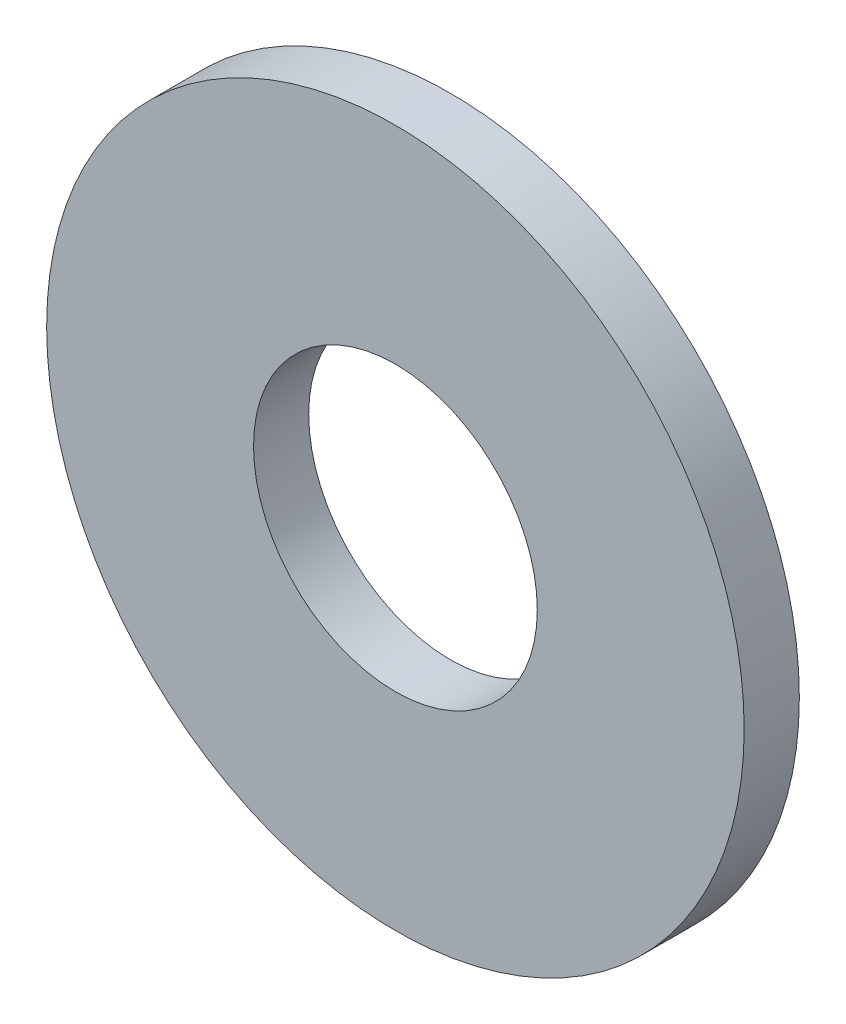
ISO-10303-21;
HEADER;
FILE_DESCRIPTION(('STEP AP214'),'2;1');
FILE_NAME('part.step','',(''),(''),'','','');
FILE_SCHEMA(('AUTOMOTIVE_DESIGN { 1 0 10303 214 1 1 1 1 }'));
ENDSEC;
DATA;
#1=APPLICATION_CONTEXT('core data for automotive mechanical design processes');
#2=APPLICATION_PROTOCOL_DEFINITION('international standard','automotive_design',2000,#1);
#3=PRODUCT_CONTEXT('',#1,'mechanical');
#4=PRODUCT('Part','Part','',(#3));
#5=PRODUCT_RELATED_PRODUCT_CATEGORY('part','',(#4));
#6=PRODUCT_DEFINITION_FORMATION('','',#4);
#7=PRODUCT_DEFINITION_CONTEXT('part definition',#1,'design');
#8=PRODUCT_DEFINITION('design','',#6,#7);
#9=PRODUCT_DEFINITION_SHAPE('','',#8);
#10=(LENGTH_UNIT() NAMED_UNIT(*) SI_UNIT(.MILLI.,.METRE.));
#11=(NAMED_UNIT(*) PLANE_ANGLE_UNIT() SI_UNIT($,.RADIAN.));
#12=(NAMED_UNIT(*) SI_UNIT($,.STERADIAN.) SOLID_ANGLE_UNIT());
#13=UNCERTAINTY_MEASURE_WITH_UNIT(LENGTH_MEASURE(1.E-05),#10,'distance_accuracy_value','');
#14=(GEOMETRIC_REPRESENTATION_CONTEXT(3) GLOBAL_UNCERTAINTY_ASSIGNED_CONTEXT((#13)) GLOBAL_UNIT_ASSIGNED_CONTEXT((#10,
#11,#12)) REPRESENTATION_CONTEXT('',''));
#15=CARTESIAN_POINT('',(0.,0.,0.));
#16=DIRECTION('',(0.,0.,1.));
#17=DIRECTION('',(1.,0.,0.));
#18=AXIS2_PLACEMENT_3D('',#15,#16,#17);
#19=CARTESIAN_POINT('',(0.,0.,1.4));
#20=DIRECTION('',(0.,0.,1.));
#21=DIRECTION('',(1.,0.,0.));
#22=AXIS2_PLACEMENT_3D('',#19,#20,#21);
#23=PLANE('',#22);
#24=CARTESIAN_POINT('',(0.,0.,1.4));
#25=DIRECTION('',(0.,0.,1.));
#26=DIRECTION('',(1.,0.,0.));
#27=AXIS2_PLACEMENT_3D('',#24,#25,#26);
#28=CIRCLE('',#27,8.85);
#29=CARTESIAN_POINT('',(8.85,0.,1.4));
#30=VERTEX_POINT('',#29);
#31=EDGE_CURVE('E10',#30,#30,#28,.T.);
#32=ORIENTED_EDGE('',*,*,#31,.T.);
#33=EDGE_LOOP('',(#32));
#34=FACE_BOUND('',#33,.T.);
#35=CARTESIAN_POINT('',(0.,0.,1.4));
#36=DIRECTION('',(0.,0.,1.));
#37=DIRECTION('',(1.,0.,0.));
#38=AXIS2_PLACEMENT_3D('',#35,#36,#37);
#39=CIRCLE('',#38,3.6);
#40=CARTESIAN_POINT('',(3.6,0.,1.4));
#41=VERTEX_POINT('',#40);
#42=EDGE_CURVE('E43',#41,#41,#39,.T.);
#43=ORIENTED_EDGE('',*,*,#42,.F.);
#44=EDGE_LOOP('',(#43));
#45=FACE_BOUND('',#44,.T.);
#46=ADVANCED_FACE('F32',(#34,#45),#23,.T.);
#47=CARTESIAN_POINT('',(0.,0.,0.));
#48=DIRECTION('',(0.,0.,1.));
#49=DIRECTION('',(1.,0.,0.));
#50=AXIS2_PLACEMENT_3D('',#47,#48,#49);
#51=PLANE('',#50);
#52=CARTESIAN_POINT('',(0.,0.,0.));
#53=DIRECTION('',(0.,0.,1.));
#54=DIRECTION('',(1.,0.,0.));
#55=AXIS2_PLACEMENT_3D('',#52,#53,#54);
#56=CIRCLE('',#55,8.85);
#57=CARTESIAN_POINT('',(8.85,0.,0.));
#58=VERTEX_POINT('',#57);
#59=EDGE_CURVE('E36',#58,#58,#56,.T.);
#60=ORIENTED_EDGE('',*,*,#59,.F.);
#61=EDGE_LOOP('',(#60));
#62=FACE_BOUND('',#61,.T.);
#63=CARTESIAN_POINT('',(0.,0.,0.));
#64=DIRECTION('',(0.,0.,1.));
#65=DIRECTION('',(1.,0.,0.));
#66=AXIS2_PLACEMENT_3D('',#63,#64,#65);
#67=CIRCLE('',#66,3.6);
#68=CARTESIAN_POINT('',(3.6,0.,0.));
#69=VERTEX_POINT('',#68);
#70=EDGE_CURVE('E45',#69,#69,#67,.T.);
#71=ORIENTED_EDGE('',*,*,#70,.T.);
#72=EDGE_LOOP('',(#71));
#73=FACE_BOUND('',#72,.T.);
#74=ADVANCED_FACE('F55',(#62,#73),#51,.F.);
#75=CARTESIAN_POINT('',(0.,0.,1.4));
#76=DIRECTION('',(0.,0.,-1.));
#77=DIRECTION('',(-1.,0.,0.));
#78=AXIS2_PLACEMENT_3D('',#75,#76,#77);
#79=CYLINDRICAL_SURFACE('',#78,8.85);
#80=ORIENTED_EDGE('',*,*,#31,.F.);
#81=EDGE_LOOP('',(#80));
#82=FACE_BOUND('',#81,.T.);
#83=ORIENTED_EDGE('',*,*,#59,.T.);
#84=EDGE_LOOP('',(#83));
#85=FACE_BOUND('',#84,.T.);
#86=ADVANCED_FACE('F34',(#82,#85),#79,.T.);
#87=CARTESIAN_POINT('',(0.,0.,1.4));
#88=DIRECTION('',(0.,0.,-1.));
#89=DIRECTION('',(-1.,0.,0.));
#90=AXIS2_PLACEMENT_3D('',#87,#88,#89);
#91=CYLINDRICAL_SURFACE('',#90,3.6);
#92=ORIENTED_EDGE('',*,*,#42,.T.);
#93=EDGE_LOOP('',(#92));
#94=FACE_BOUND('',#93,.T.);
#95=ORIENTED_EDGE('',*,*,#70,.F.);
#96=EDGE_LOOP('',(#95));
#97=FACE_BOUND('',#96,.T.);
#98=ADVANCED_FACE('F51',(#94,#97),#91,.F.);
#99=CLOSED_SHELL('',(#46,#74,#86,#98));
#100=MANIFOLD_SOLID_BREP('B2',#99);
#101=ADVANCED_BREP_SHAPE_REPRESENTATION('',(#18,#100),#14);
#102=SHAPE_DEFINITION_REPRESENTATION(#9,#101);
ENDSEC;
END-ISO-10303-21;
